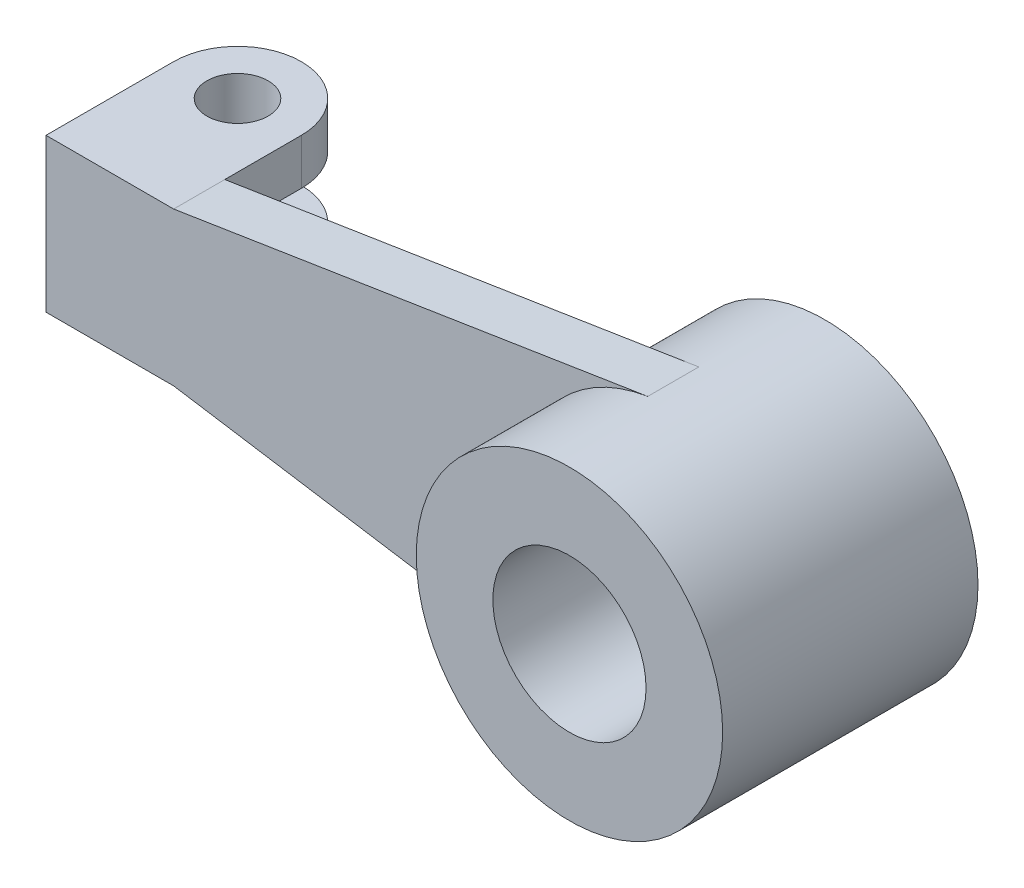
ISO-10303-21;
HEADER;
FILE_DESCRIPTION(('STEP AP214'),'2;1');
FILE_NAME('part.step','',(''),(''),'','','');
FILE_SCHEMA(('AUTOMOTIVE_DESIGN { 1 0 10303 214 1 1 1 1 }'));
ENDSEC;
DATA;
#1=APPLICATION_CONTEXT('core data for automotive mechanical design processes');
#2=APPLICATION_PROTOCOL_DEFINITION('international standard','automotive_design',2000,#1);
#3=PRODUCT_CONTEXT('',#1,'mechanical');
#4=PRODUCT('Part','Part','',(#3));
#5=PRODUCT_RELATED_PRODUCT_CATEGORY('part','',(#4));
#6=PRODUCT_DEFINITION_FORMATION('','',#4);
#7=PRODUCT_DEFINITION_CONTEXT('part definition',#1,'design');
#8=PRODUCT_DEFINITION('design','',#6,#7);
#9=PRODUCT_DEFINITION_SHAPE('','',#8);
#10=(LENGTH_UNIT() NAMED_UNIT(*) SI_UNIT(.MILLI.,.METRE.));
#11=(NAMED_UNIT(*) PLANE_ANGLE_UNIT() SI_UNIT($,.RADIAN.));
#12=(NAMED_UNIT(*) SI_UNIT($,.STERADIAN.) SOLID_ANGLE_UNIT());
#13=UNCERTAINTY_MEASURE_WITH_UNIT(LENGTH_MEASURE(1.E-05),#10,'distance_accuracy_value','');
#14=(GEOMETRIC_REPRESENTATION_CONTEXT(3) GLOBAL_UNCERTAINTY_ASSIGNED_CONTEXT((#13)) GLOBAL_UNIT_ASSIGNED_CONTEXT((#10,
#11,#12)) REPRESENTATION_CONTEXT('',''));
#15=CARTESIAN_POINT('',(0.,0.,0.));
#16=DIRECTION('',(0.,0.,1.));
#17=DIRECTION('',(1.,0.,0.));
#18=AXIS2_PLACEMENT_3D('',#15,#16,#17);
#19=CARTESIAN_POINT('',(0.,0.,25.));
#20=DIRECTION('',(0.,0.,1.));
#21=DIRECTION('',(1.,0.,0.));
#22=AXIS2_PLACEMENT_3D('',#19,#20,#21);
#23=PLANE('',#22);
#24=CARTESIAN_POINT('',(0.,0.,25.));
#25=DIRECTION('',(0.,0.,1.));
#26=DIRECTION('',(1.,0.,0.));
#27=AXIS2_PLACEMENT_3D('',#24,#25,#26);
#28=CIRCLE('',#27,30.);
#29=CARTESIAN_POINT('',(30.,0.,25.));
#30=VERTEX_POINT('',#29);
#31=EDGE_CURVE('E11',#30,#30,#28,.T.);
#32=ORIENTED_EDGE('',*,*,#31,.T.);
#33=EDGE_LOOP('',(#32));
#34=FACE_BOUND('',#33,.T.);
#35=CARTESIAN_POINT('',(0.,0.,25.));
#36=DIRECTION('',(0.,0.,1.));
#37=DIRECTION('',(1.,0.,0.));
#38=AXIS2_PLACEMENT_3D('',#35,#36,#37);
#39=CIRCLE('',#38,15.);
#40=CARTESIAN_POINT('',(15.,0.,25.));
#41=VERTEX_POINT('',#40);
#42=EDGE_CURVE('E221',#41,#41,#39,.T.);
#43=ORIENTED_EDGE('',*,*,#42,.F.);
#44=EDGE_LOOP('',(#43));
#45=FACE_BOUND('',#44,.T.);
#46=ADVANCED_FACE('F33',(#34,#45),#23,.T.);
#47=CARTESIAN_POINT('',(0.,0.,-25.));
#48=DIRECTION('',(0.,0.,1.));
#49=DIRECTION('',(1.,0.,0.));
#50=AXIS2_PLACEMENT_3D('',#47,#48,#49);
#51=PLANE('',#50);
#52=CARTESIAN_POINT('',(0.,0.,-25.));
#53=DIRECTION('',(0.,0.,1.));
#54=DIRECTION('',(1.,0.,0.));
#55=AXIS2_PLACEMENT_3D('',#52,#53,#54);
#56=CIRCLE('',#55,30.);
#57=CARTESIAN_POINT('',(30.,0.,-25.));
#58=VERTEX_POINT('',#57);
#59=EDGE_CURVE('E37',#58,#58,#56,.T.);
#60=ORIENTED_EDGE('',*,*,#59,.F.);
#61=EDGE_LOOP('',(#60));
#62=FACE_BOUND('',#61,.T.);
#63=CARTESIAN_POINT('',(0.,0.,-25.));
#64=DIRECTION('',(0.,0.,1.));
#65=DIRECTION('',(1.,0.,0.));
#66=AXIS2_PLACEMENT_3D('',#63,#64,#65);
#67=CIRCLE('',#66,15.);
#68=CARTESIAN_POINT('',(15.,0.,-25.));
#69=VERTEX_POINT('',#68);
#70=EDGE_CURVE('E210',#69,#69,#67,.T.);
#71=ORIENTED_EDGE('',*,*,#70,.T.);
#72=EDGE_LOOP('',(#71));
#73=FACE_BOUND('',#72,.T.);
#74=ADVANCED_FACE('F227',(#62,#73),#51,.F.);
#75=CARTESIAN_POINT('',(0.,0.,25.));
#76=DIRECTION('',(0.,0.,-1.));
#77=DIRECTION('',(-1.,0.,0.));
#78=AXIS2_PLACEMENT_3D('',#75,#76,#77);
#79=CYLINDRICAL_SURFACE('',#78,30.);
#80=DIRECTION('',(0.,0.,-1.));
#81=VECTOR('',#80,1.);
#82=CARTESIAN_POINT('',(-4.67168875625145,29.6340230843656,5.));
#83=LINE('',#82,#81);
#84=CARTESIAN_POINT('',(-4.67168875625145,29.6340230843656,5.));
#85=VERTEX_POINT('',#84);
#86=CARTESIAN_POINT('',(-4.67168875625145,29.6340230843656,-5.));
#87=VERTEX_POINT('',#86);
#88=EDGE_CURVE('E199',#85,#87,#83,.T.);
#89=ORIENTED_EDGE('',*,*,#88,.F.);
#90=CARTESIAN_POINT('',(0.,0.,5.));
#91=DIRECTION('',(0.,0.,1.));
#92=DIRECTION('',(1.,0.,0.));
#93=AXIS2_PLACEMENT_3D('',#90,#91,#92);
#94=CIRCLE('',#93,30.);
#95=CARTESIAN_POINT('',(-4.67168875625144,-29.6340230843656,5.));
#96=VERTEX_POINT('',#95);
#97=EDGE_CURVE('E186',#85,#96,#94,.T.);
#98=ORIENTED_EDGE('',*,*,#97,.T.);
#99=DIRECTION('',(0.,0.,-1.));
#100=VECTOR('',#99,1.);
#101=CARTESIAN_POINT('',(-4.67168875625145,-29.6340230843656,5.));
#102=LINE('',#101,#100);
#103=CARTESIAN_POINT('',(-4.67168875625145,-29.6340230843656,-5.));
#104=VERTEX_POINT('',#103);
#105=EDGE_CURVE('E217',#96,#104,#102,.T.);
#106=ORIENTED_EDGE('',*,*,#105,.T.);
#107=CARTESIAN_POINT('',(0.,0.,-5.));
#108=DIRECTION('',(0.,0.,1.));
#109=DIRECTION('',(1.,0.,0.));
#110=AXIS2_PLACEMENT_3D('',#107,#108,#109);
#111=CIRCLE('',#110,30.);
#112=EDGE_CURVE('E202',#87,#104,#111,.T.);
#113=ORIENTED_EDGE('',*,*,#112,.F.);
#114=EDGE_LOOP('',(#89,#98,#106,#113));
#115=FACE_BOUND('',#114,.T.);
#116=ORIENTED_EDGE('',*,*,#31,.F.);
#117=EDGE_LOOP('',(#116));
#118=FACE_BOUND('',#117,.T.);
#119=ORIENTED_EDGE('',*,*,#59,.T.);
#120=EDGE_LOOP('',(#119));
#121=FACE_BOUND('',#120,.T.);
#122=ADVANCED_FACE('F35',(#115,#118,#121),#79,.T.);
#123=CARTESIAN_POINT('',(0.,0.,25.));
#124=DIRECTION('',(0.,0.,-1.));
#125=DIRECTION('',(-1.,0.,0.));
#126=AXIS2_PLACEMENT_3D('',#123,#124,#125);
#127=CYLINDRICAL_SURFACE('',#126,15.);
#128=ORIENTED_EDGE('',*,*,#42,.T.);
#129=EDGE_LOOP('',(#128));
#130=FACE_BOUND('',#129,.T.);
#131=ORIENTED_EDGE('',*,*,#70,.F.);
#132=EDGE_LOOP('',(#131));
#133=FACE_BOUND('',#132,.T.);
#134=ADVANCED_FACE('F229',(#130,#133),#127,.F.);
#135=CARTESIAN_POINT('',(-97.5,15.,5.));
#136=DIRECTION('',(-0.155722958541715,0.987800769478854,0.));
#137=DIRECTION('',(-0.987800769478854,-0.155722958541715,0.));
#138=AXIS2_PLACEMENT_3D('',#135,#136,#137);
#139=PLANE('',#138);
#140=DIRECTION('',(0.987800769478854,0.155722958541715,0.));
#141=VECTOR('',#140,1.);
#142=CARTESIAN_POINT('',(-97.5,15.,-5.));
#143=LINE('',#142,#141);
#144=CARTESIAN_POINT('',(-97.5,15.,-5.));
#145=VERTEX_POINT('',#144);
#146=EDGE_CURVE('E180',#145,#87,#143,.T.);
#147=ORIENTED_EDGE('',*,*,#146,.F.);
#148=DIRECTION('',(0.,0.,-1.));
#149=VECTOR('',#148,1.);
#150=CARTESIAN_POINT('',(-97.5,15.,5.));
#151=LINE('',#150,#149);
#152=CARTESIAN_POINT('',(-97.5,15.,5.));
#153=VERTEX_POINT('',#152);
#154=EDGE_CURVE('E207',#153,#145,#151,.T.);
#155=ORIENTED_EDGE('',*,*,#154,.F.);
#156=DIRECTION('',(0.987800769478854,0.155722958541715,0.));
#157=VECTOR('',#156,1.);
#158=CARTESIAN_POINT('',(-97.5,15.,5.));
#159=LINE('',#158,#157);
#160=EDGE_CURVE('E125',#153,#85,#159,.T.);
#161=ORIENTED_EDGE('',*,*,#160,.T.);
#162=ORIENTED_EDGE('',*,*,#88,.T.);
#163=EDGE_LOOP('',(#147,#155,#161,#162));
#164=FACE_BOUND('',#163,.T.);
#165=ADVANCED_FACE('F231',(#164),#139,.T.);
#166=CARTESIAN_POINT('',(-122.5,15.,5.));
#167=DIRECTION('',(0.,1.,0.));
#168=DIRECTION('',(-1.,0.,0.));
#169=AXIS2_PLACEMENT_3D('',#166,#167,#168);
#170=PLANE('',#169);
#171=ORIENTED_EDGE('',*,*,#154,.T.);
#172=DIRECTION('',(0.,0.,-1.));
#173=VECTOR('',#172,1.);
#174=CARTESIAN_POINT('',(-97.5,15.,-5.));
#175=LINE('',#174,#173);
#176=CARTESIAN_POINT('',(-97.5,15.,-20.));
#177=VERTEX_POINT('',#176);
#178=EDGE_CURVE('E160',#145,#177,#175,.T.);
#179=ORIENTED_EDGE('',*,*,#178,.T.);
#180=CARTESIAN_POINT('',(-110.,15.,-20.));
#181=DIRECTION('',(0.,1.,0.));
#182=DIRECTION('',(1.,0.,0.));
#183=AXIS2_PLACEMENT_3D('',#180,#181,#182);
#184=CIRCLE('',#183,12.5);
#185=CARTESIAN_POINT('',(-122.5,15.,-20.));
#186=VERTEX_POINT('',#185);
#187=EDGE_CURVE('E165',#177,#186,#184,.T.);
#188=ORIENTED_EDGE('',*,*,#187,.T.);
#189=DIRECTION('',(0.,0.,-1.));
#190=VECTOR('',#189,1.);
#191=CARTESIAN_POINT('',(-122.5,15.,5.));
#192=LINE('',#191,#190);
#193=CARTESIAN_POINT('',(-122.5,15.,5.));
#194=VERTEX_POINT('',#193);
#195=EDGE_CURVE('E211',#194,#186,#192,.T.);
#196=ORIENTED_EDGE('',*,*,#195,.F.);
#197=DIRECTION('',(1.,0.,0.));
#198=VECTOR('',#197,1.);
#199=CARTESIAN_POINT('',(-122.5,15.,5.));
#200=LINE('',#199,#198);
#201=EDGE_CURVE('E196',#194,#153,#200,.T.);
#202=ORIENTED_EDGE('',*,*,#201,.T.);
#203=EDGE_LOOP('',(#171,#179,#188,#196,#202));
#204=FACE_BOUND('',#203,.T.);
#205=CARTESIAN_POINT('',(-110.,15.,-20.));
#206=DIRECTION('',(0.,1.,0.));
#207=DIRECTION('',(-1.,0.,0.));
#208=AXIS2_PLACEMENT_3D('',#205,#206,#207);
#209=CIRCLE('',#208,6.);
#210=CARTESIAN_POINT('',(-116.,15.,-20.));
#211=VERTEX_POINT('',#210);
#212=EDGE_CURVE('E152',#211,#211,#209,.T.);
#213=ORIENTED_EDGE('',*,*,#212,.F.);
#214=EDGE_LOOP('',(#213));
#215=FACE_BOUND('',#214,.T.);
#216=ADVANCED_FACE('F238',(#204,#215),#170,.T.);
#217=CARTESIAN_POINT('',(-122.5,-15.,5.));
#218=DIRECTION('',(-1.,0.,0.));
#219=DIRECTION('',(0.,0.,1.));
#220=AXIS2_PLACEMENT_3D('',#217,#218,#219);
#221=PLANE('',#220);
#222=DIRECTION('',(0.,1.,0.));
#223=VECTOR('',#222,1.);
#224=CARTESIAN_POINT('',(-122.5,-15.,-5.));
#225=LINE('',#224,#223);
#226=CARTESIAN_POINT('',(-122.5,-5.99999999999998,-5.));
#227=VERTEX_POINT('',#226);
#228=CARTESIAN_POINT('',(-122.5,5.99999999999999,-5.));
#229=VERTEX_POINT('',#228);
#230=EDGE_CURVE('E118',#227,#229,#225,.T.);
#231=ORIENTED_EDGE('',*,*,#230,.F.);
#232=DIRECTION('',(0.,0.,1.));
#233=VECTOR('',#232,1.);
#234=CARTESIAN_POINT('',(-122.5,-5.99999999999998,-5.));
#235=LINE('',#234,#233);
#236=CARTESIAN_POINT('',(-122.5,-5.99999999999998,-20.));
#237=VERTEX_POINT('',#236);
#238=EDGE_CURVE('E122',#237,#227,#235,.T.);
#239=ORIENTED_EDGE('',*,*,#238,.F.);
#240=DIRECTION('',(0.,-1.,0.));
#241=VECTOR('',#240,1.);
#242=CARTESIAN_POINT('',(-122.5,-5.99999999999998,-20.));
#243=LINE('',#242,#241);
#244=CARTESIAN_POINT('',(-122.5,-15.,-20.));
#245=VERTEX_POINT('',#244);
#246=EDGE_CURVE('E145',#237,#245,#243,.T.);
#247=ORIENTED_EDGE('',*,*,#246,.T.);
#248=DIRECTION('',(0.,0.,-1.));
#249=VECTOR('',#248,1.);
#250=CARTESIAN_POINT('',(-122.5,-15.,5.));
#251=LINE('',#250,#249);
#252=CARTESIAN_POINT('',(-122.5,-15.,5.));
#253=VERTEX_POINT('',#252);
#254=EDGE_CURVE('E213',#253,#245,#251,.T.);
#255=ORIENTED_EDGE('',*,*,#254,.F.);
#256=DIRECTION('',(0.,1.,0.));
#257=VECTOR('',#256,1.);
#258=CARTESIAN_POINT('',(-122.5,-15.,5.));
#259=LINE('',#258,#257);
#260=EDGE_CURVE('E193',#253,#194,#259,.T.);
#261=ORIENTED_EDGE('',*,*,#260,.T.);
#262=ORIENTED_EDGE('',*,*,#195,.T.);
#263=DIRECTION('',(0.,1.,0.));
#264=VECTOR('',#263,1.);
#265=CARTESIAN_POINT('',(-122.5,5.99999999999998,-20.));
#266=LINE('',#265,#264);
#267=CARTESIAN_POINT('',(-122.5,5.99999999999998,-20.));
#268=VERTEX_POINT('',#267);
#269=EDGE_CURVE('E177',#268,#186,#266,.T.);
#270=ORIENTED_EDGE('',*,*,#269,.F.);
#271=DIRECTION('',(0.,0.,1.));
#272=VECTOR('',#271,1.);
#273=CARTESIAN_POINT('',(-122.5,5.99999999999998,-5.));
#274=LINE('',#273,#272);
#275=EDGE_CURVE('E124',#268,#229,#274,.T.);
#276=ORIENTED_EDGE('',*,*,#275,.T.);
#277=EDGE_LOOP('',(#231,#239,#247,#255,#261,#262,#270,#276));
#278=FACE_BOUND('',#277,.T.);
#279=ADVANCED_FACE('F119',(#278),#221,.T.);
#280=CARTESIAN_POINT('',(-122.5,-15.,5.));
#281=DIRECTION('',(0.,1.,0.));
#282=DIRECTION('',(-1.,0.,0.));
#283=AXIS2_PLACEMENT_3D('',#280,#281,#282);
#284=PLANE('',#283);
#285=ORIENTED_EDGE('',*,*,#254,.T.);
#286=CARTESIAN_POINT('',(-110.,-15.,-20.));
#287=DIRECTION('',(0.,1.,0.));
#288=DIRECTION('',(1.,0.,0.));
#289=AXIS2_PLACEMENT_3D('',#286,#287,#288);
#290=CIRCLE('',#289,12.5);
#291=CARTESIAN_POINT('',(-97.5,-15.,-20.));
#292=VERTEX_POINT('',#291);
#293=EDGE_CURVE('E146',#292,#245,#290,.T.);
#294=ORIENTED_EDGE('',*,*,#293,.F.);
#295=DIRECTION('',(0.,0.,-1.));
#296=VECTOR('',#295,1.);
#297=CARTESIAN_POINT('',(-97.5,-15.,-5.));
#298=LINE('',#297,#296);
#299=CARTESIAN_POINT('',(-97.5,-15.,-5.));
#300=VERTEX_POINT('',#299);
#301=EDGE_CURVE('E132',#300,#292,#298,.T.);
#302=ORIENTED_EDGE('',*,*,#301,.F.);
#303=DIRECTION('',(0.,0.,-1.));
#304=VECTOR('',#303,1.);
#305=CARTESIAN_POINT('',(-97.5,-15.,5.));
#306=LINE('',#305,#304);
#307=CARTESIAN_POINT('',(-97.5,-15.,5.));
#308=VERTEX_POINT('',#307);
#309=EDGE_CURVE('E215',#308,#300,#306,.T.);
#310=ORIENTED_EDGE('',*,*,#309,.F.);
#311=DIRECTION('',(1.,0.,0.));
#312=VECTOR('',#311,1.);
#313=CARTESIAN_POINT('',(-122.5,-15.,5.));
#314=LINE('',#313,#312);
#315=EDGE_CURVE('E191',#253,#308,#314,.T.);
#316=ORIENTED_EDGE('',*,*,#315,.F.);
#317=EDGE_LOOP('',(#285,#294,#302,#310,#316));
#318=FACE_BOUND('',#317,.T.);
#319=CARTESIAN_POINT('',(-110.,-15.,-20.));
#320=DIRECTION('',(0.,1.,0.));
#321=DIRECTION('',(-1.,0.,0.));
#322=AXIS2_PLACEMENT_3D('',#319,#320,#321);
#323=CIRCLE('',#322,6.);
#324=CARTESIAN_POINT('',(-116.,-15.,-20.));
#325=VERTEX_POINT('',#324);
#326=EDGE_CURVE('E411',#325,#325,#323,.T.);
#327=ORIENTED_EDGE('',*,*,#326,.T.);
#328=EDGE_LOOP('',(#327));
#329=FACE_BOUND('',#328,.T.);
#330=ADVANCED_FACE('F347',(#318,#329),#284,.F.);
#331=CARTESIAN_POINT('',(-97.5,-15.,5.));
#332=DIRECTION('',(0.155722958541715,0.987800769478854,0.));
#333=DIRECTION('',(-0.987800769478854,0.155722958541715,0.));
#334=AXIS2_PLACEMENT_3D('',#331,#332,#333);
#335=PLANE('',#334);
#336=DIRECTION('',(0.987800769478854,-0.155722958541715,0.));
#337=VECTOR('',#336,1.);
#338=CARTESIAN_POINT('',(-97.5,-15.,-5.));
#339=LINE('',#338,#337);
#340=EDGE_CURVE('E126',#300,#104,#339,.T.);
#341=ORIENTED_EDGE('',*,*,#340,.T.);
#342=ORIENTED_EDGE('',*,*,#105,.F.);
#343=DIRECTION('',(0.987800769478854,-0.155722958541715,0.));
#344=VECTOR('',#343,1.);
#345=CARTESIAN_POINT('',(-97.5,-15.,5.));
#346=LINE('',#345,#344);
#347=EDGE_CURVE('E188',#308,#96,#346,.T.);
#348=ORIENTED_EDGE('',*,*,#347,.F.);
#349=ORIENTED_EDGE('',*,*,#309,.T.);
#350=EDGE_LOOP('',(#341,#342,#348,#349));
#351=FACE_BOUND('',#350,.T.);
#352=ADVANCED_FACE('F282',(#351),#335,.F.);
#353=CARTESIAN_POINT('',(0.,0.,5.));
#354=DIRECTION('',(0.,0.,1.));
#355=DIRECTION('',(1.,0.,0.));
#356=AXIS2_PLACEMENT_3D('',#353,#354,#355);
#357=PLANE('',#356);
#358=ORIENTED_EDGE('',*,*,#160,.F.);
#359=ORIENTED_EDGE('',*,*,#201,.F.);
#360=ORIENTED_EDGE('',*,*,#260,.F.);
#361=ORIENTED_EDGE('',*,*,#315,.T.);
#362=ORIENTED_EDGE('',*,*,#347,.T.);
#363=ORIENTED_EDGE('',*,*,#97,.F.);
#364=EDGE_LOOP('',(#358,#359,#360,#361,#362,#363));
#365=FACE_BOUND('',#364,.T.);
#366=ADVANCED_FACE('F277',(#365),#357,.T.);
#367=CARTESIAN_POINT('',(0.,0.,-5.));
#368=DIRECTION('',(0.,0.,1.));
#369=DIRECTION('',(1.,0.,0.));
#370=AXIS2_PLACEMENT_3D('',#367,#368,#369);
#371=PLANE('',#370);
#372=DIRECTION('',(0.,-1.,0.));
#373=VECTOR('',#372,1.);
#374=CARTESIAN_POINT('',(-97.5,-5.99999999999999,-5.));
#375=LINE('',#374,#373);
#376=CARTESIAN_POINT('',(-97.5,-5.99999999999999,-5.));
#377=VERTEX_POINT('',#376);
#378=EDGE_CURVE('E48',#377,#300,#375,.T.);
#379=ORIENTED_EDGE('',*,*,#378,.F.);
#380=DIRECTION('',(1.,0.,0.));
#381=VECTOR('',#380,1.);
#382=CARTESIAN_POINT('',(-122.5,-5.99999999999998,-5.));
#383=LINE('',#382,#381);
#384=EDGE_CURVE('E129',#227,#377,#383,.T.);
#385=ORIENTED_EDGE('',*,*,#384,.F.);
#386=ORIENTED_EDGE('',*,*,#230,.T.);
#387=DIRECTION('',(1.,0.,0.));
#388=VECTOR('',#387,1.);
#389=CARTESIAN_POINT('',(-122.5,5.99999999999998,-5.));
#390=LINE('',#389,#388);
#391=CARTESIAN_POINT('',(-97.5,5.99999999999999,-5.));
#392=VERTEX_POINT('',#391);
#393=EDGE_CURVE('E55',#229,#392,#390,.T.);
#394=ORIENTED_EDGE('',*,*,#393,.T.);
#395=DIRECTION('',(0.,1.,0.));
#396=VECTOR('',#395,1.);
#397=CARTESIAN_POINT('',(-97.5,5.99999999999999,-5.));
#398=LINE('',#397,#396);
#399=EDGE_CURVE('E172',#392,#145,#398,.T.);
#400=ORIENTED_EDGE('',*,*,#399,.T.);
#401=ORIENTED_EDGE('',*,*,#146,.T.);
#402=ORIENTED_EDGE('',*,*,#112,.T.);
#403=ORIENTED_EDGE('',*,*,#340,.F.);
#404=EDGE_LOOP('',(#379,#385,#386,#394,#400,#401,#402,#403));
#405=FACE_BOUND('',#404,.T.);
#406=ADVANCED_FACE('F130',(#405),#371,.F.);
#407=CARTESIAN_POINT('',(-110.,5.99999999999999,-20.));
#408=DIRECTION('',(0.,1.,0.));
#409=DIRECTION('',(-1.,0.,0.));
#410=AXIS2_PLACEMENT_3D('',#407,#408,#409);
#411=CYLINDRICAL_SURFACE('',#410,12.5);
#412=ORIENTED_EDGE('',*,*,#187,.F.);
#413=DIRECTION('',(0.,1.,0.));
#414=VECTOR('',#413,1.);
#415=CARTESIAN_POINT('',(-97.5,5.99999999999999,-20.));
#416=LINE('',#415,#414);
#417=CARTESIAN_POINT('',(-97.5,5.99999999999999,-20.));
#418=VERTEX_POINT('',#417);
#419=EDGE_CURVE('E181',#418,#177,#416,.T.);
#420=ORIENTED_EDGE('',*,*,#419,.F.);
#421=CARTESIAN_POINT('',(-110.,5.99999999999999,-20.));
#422=DIRECTION('',(0.,1.,0.));
#423=DIRECTION('',(1.,0.,0.));
#424=AXIS2_PLACEMENT_3D('',#421,#422,#423);
#425=CIRCLE('',#424,12.5);
#426=EDGE_CURVE('E168',#418,#268,#425,.T.);
#427=ORIENTED_EDGE('',*,*,#426,.T.);
#428=ORIENTED_EDGE('',*,*,#269,.T.);
#429=EDGE_LOOP('',(#412,#420,#427,#428));
#430=FACE_BOUND('',#429,.T.);
#431=ADVANCED_FACE('F302',(#430),#411,.T.);
#432=CARTESIAN_POINT('',(-97.5,5.99999999999999,-5.));
#433=DIRECTION('',(1.,0.,0.));
#434=DIRECTION('',(0.,1.,0.));
#435=AXIS2_PLACEMENT_3D('',#432,#433,#434);
#436=PLANE('',#435);
#437=ORIENTED_EDGE('',*,*,#178,.F.);
#438=ORIENTED_EDGE('',*,*,#399,.F.);
#439=DIRECTION('',(0.,0.,-1.));
#440=VECTOR('',#439,1.);
#441=CARTESIAN_POINT('',(-97.5,5.99999999999999,-5.));
#442=LINE('',#441,#440);
#443=EDGE_CURVE('E164',#392,#418,#442,.T.);
#444=ORIENTED_EDGE('',*,*,#443,.T.);
#445=ORIENTED_EDGE('',*,*,#419,.T.);
#446=EDGE_LOOP('',(#437,#438,#444,#445));
#447=FACE_BOUND('',#446,.T.);
#448=ADVANCED_FACE('F307',(#447),#436,.T.);
#449=CARTESIAN_POINT('',(-110.,5.99999999999999,-20.));
#450=DIRECTION('',(0.,-1.,0.));
#451=DIRECTION('',(1.,0.,0.));
#452=AXIS2_PLACEMENT_3D('',#449,#450,#451);
#453=PLANE('',#452);
#454=CARTESIAN_POINT('',(-110.,5.99999999999999,-20.));
#455=DIRECTION('',(0.,1.,0.));
#456=DIRECTION('',(-1.,0.,0.));
#457=AXIS2_PLACEMENT_3D('',#454,#455,#456);
#458=CIRCLE('',#457,6.);
#459=CARTESIAN_POINT('',(-116.,5.99999999999999,-20.));
#460=VERTEX_POINT('',#459);
#461=EDGE_CURVE('E157',#460,#460,#458,.T.);
#462=ORIENTED_EDGE('',*,*,#461,.T.);
#463=EDGE_LOOP('',(#462));
#464=FACE_BOUND('',#463,.T.);
#465=ORIENTED_EDGE('',*,*,#393,.F.);
#466=ORIENTED_EDGE('',*,*,#275,.F.);
#467=ORIENTED_EDGE('',*,*,#426,.F.);
#468=ORIENTED_EDGE('',*,*,#443,.F.);
#469=EDGE_LOOP('',(#465,#466,#467,#468));
#470=FACE_BOUND('',#469,.T.);
#471=ADVANCED_FACE('F318',(#464,#470),#453,.T.);
#472=CARTESIAN_POINT('',(-110.,5.99999999999999,-20.));
#473=DIRECTION('',(0.,1.,0.));
#474=DIRECTION('',(-1.,0.,0.));
#475=AXIS2_PLACEMENT_3D('',#472,#473,#474);
#476=CYLINDRICAL_SURFACE('',#475,6.);
#477=ORIENTED_EDGE('',*,*,#461,.F.);
#478=EDGE_LOOP('',(#477));
#479=FACE_BOUND('',#478,.T.);
#480=ORIENTED_EDGE('',*,*,#212,.T.);
#481=EDGE_LOOP('',(#480));
#482=FACE_BOUND('',#481,.T.);
#483=ADVANCED_FACE('F328',(#479,#482),#476,.F.);
#484=CARTESIAN_POINT('',(-110.,-5.99999999999999,-20.));
#485=DIRECTION('',(0.,1.,0.));
#486=DIRECTION('',(1.,0.,0.));
#487=AXIS2_PLACEMENT_3D('',#484,#485,#486);
#488=PLANE('',#487);
#489=ORIENTED_EDGE('',*,*,#384,.T.);
#490=DIRECTION('',(0.,0.,-1.));
#491=VECTOR('',#490,1.);
#492=CARTESIAN_POINT('',(-97.5,-5.99999999999999,-5.));
#493=LINE('',#492,#491);
#494=CARTESIAN_POINT('',(-97.5,-5.99999999999999,-20.));
#495=VERTEX_POINT('',#494);
#496=EDGE_CURVE('E140',#377,#495,#493,.T.);
#497=ORIENTED_EDGE('',*,*,#496,.T.);
#498=CARTESIAN_POINT('',(-110.,-5.99999999999999,-20.));
#499=DIRECTION('',(0.,1.,0.));
#500=DIRECTION('',(1.,0.,0.));
#501=AXIS2_PLACEMENT_3D('',#498,#499,#500);
#502=CIRCLE('',#501,12.5);
#503=EDGE_CURVE('E137',#495,#237,#502,.T.);
#504=ORIENTED_EDGE('',*,*,#503,.T.);
#505=ORIENTED_EDGE('',*,*,#238,.T.);
#506=EDGE_LOOP('',(#489,#497,#504,#505));
#507=FACE_BOUND('',#506,.T.);
#508=CARTESIAN_POINT('',(-110.,-5.99999999999999,-20.));
#509=DIRECTION('',(0.,1.,0.));
#510=DIRECTION('',(-1.,0.,0.));
#511=AXIS2_PLACEMENT_3D('',#508,#509,#510);
#512=CIRCLE('',#511,6.);
#513=CARTESIAN_POINT('',(-116.,-5.99999999999999,-20.));
#514=VERTEX_POINT('',#513);
#515=EDGE_CURVE('E149',#514,#514,#512,.T.);
#516=ORIENTED_EDGE('',*,*,#515,.F.);
#517=EDGE_LOOP('',(#516));
#518=FACE_BOUND('',#517,.T.);
#519=ADVANCED_FACE('F134',(#507,#518),#488,.T.);
#520=CARTESIAN_POINT('',(-97.5,-5.99999999999999,-5.));
#521=DIRECTION('',(-1.,0.,0.));
#522=DIRECTION('',(0.,-1.,0.));
#523=AXIS2_PLACEMENT_3D('',#520,#521,#522);
#524=PLANE('',#523);
#525=ORIENTED_EDGE('',*,*,#301,.T.);
#526=DIRECTION('',(0.,-1.,0.));
#527=VECTOR('',#526,1.);
#528=CARTESIAN_POINT('',(-97.5,-5.99999999999999,-20.));
#529=LINE('',#528,#527);
#530=EDGE_CURVE('E153',#495,#292,#529,.T.);
#531=ORIENTED_EDGE('',*,*,#530,.F.);
#532=ORIENTED_EDGE('',*,*,#496,.F.);
#533=ORIENTED_EDGE('',*,*,#378,.T.);
#534=EDGE_LOOP('',(#525,#531,#532,#533));
#535=FACE_BOUND('',#534,.T.);
#536=ADVANCED_FACE('F373',(#535),#524,.F.);
#537=CARTESIAN_POINT('',(-110.,-5.99999999999999,-20.));
#538=DIRECTION('',(0.,-1.,0.));
#539=DIRECTION('',(1.,0.,0.));
#540=AXIS2_PLACEMENT_3D('',#537,#538,#539);
#541=CYLINDRICAL_SURFACE('',#540,12.5);
#542=ORIENTED_EDGE('',*,*,#293,.T.);
#543=ORIENTED_EDGE('',*,*,#246,.F.);
#544=ORIENTED_EDGE('',*,*,#503,.F.);
#545=ORIENTED_EDGE('',*,*,#530,.T.);
#546=EDGE_LOOP('',(#542,#543,#544,#545));
#547=FACE_BOUND('',#546,.T.);
#548=ADVANCED_FACE('F382',(#547),#541,.T.);
#549=CARTESIAN_POINT('',(-110.,-5.99999999999999,-20.));
#550=DIRECTION('',(0.,-1.,0.));
#551=DIRECTION('',(1.,0.,0.));
#552=AXIS2_PLACEMENT_3D('',#549,#550,#551);
#553=CYLINDRICAL_SURFACE('',#552,6.);
#554=ORIENTED_EDGE('',*,*,#515,.T.);
#555=EDGE_LOOP('',(#554));
#556=FACE_BOUND('',#555,.T.);
#557=ORIENTED_EDGE('',*,*,#326,.F.);
#558=EDGE_LOOP('',(#557));
#559=FACE_BOUND('',#558,.T.);
#560=ADVANCED_FACE('F392',(#556,#559),#553,.F.);
#561=CLOSED_SHELL('',(#46,#74,#122,#134,#165,#216,#279,#330,#352,#366,#406,#431,#448,#471,#483,
#519,#536,#548,#560));
#562=MANIFOLD_SOLID_BREP('B2',#561);
#563=ADVANCED_BREP_SHAPE_REPRESENTATION('',(#18,#562),#14);
#564=SHAPE_DEFINITION_REPRESENTATION(#9,#563);
ENDSEC;
END-ISO-10303-21;
